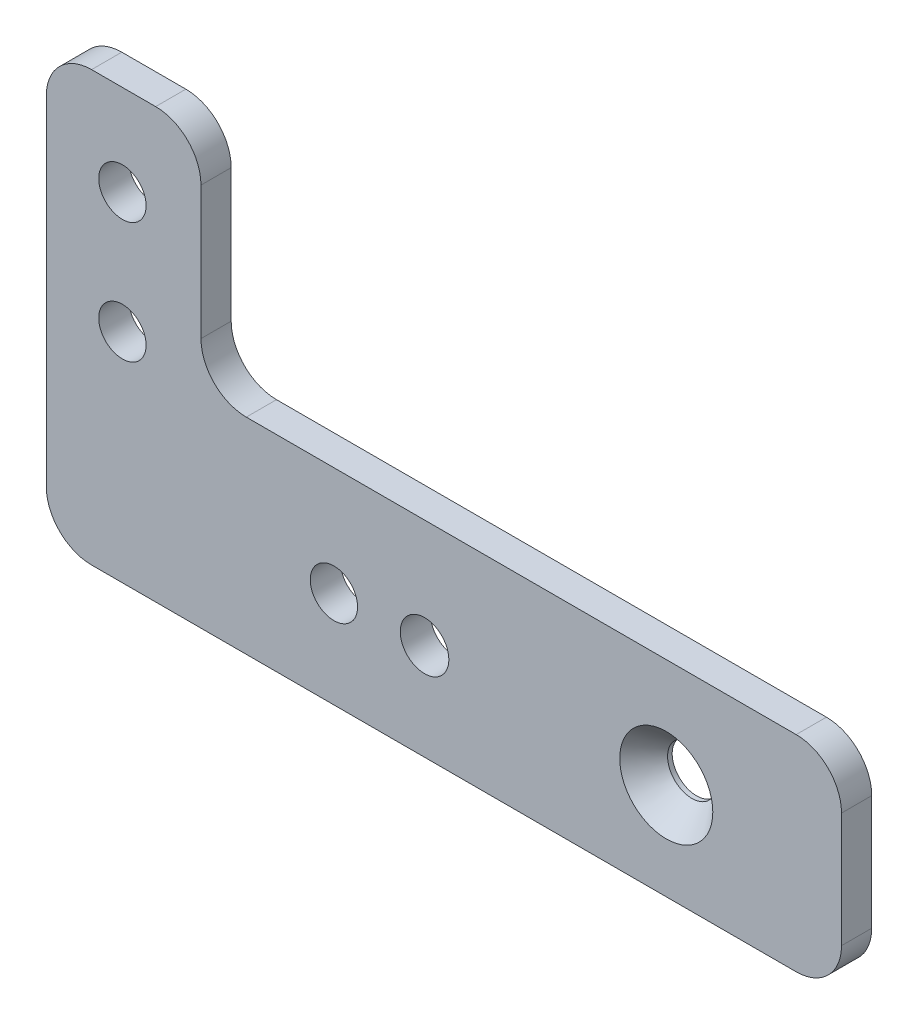
ISO-10303-21;
HEADER;
FILE_DESCRIPTION(('STEP AP214'),'2;1');
FILE_NAME('part.step','',(''),(''),'','','');
FILE_SCHEMA(('AUTOMOTIVE_DESIGN { 1 0 10303 214 1 1 1 1 }'));
ENDSEC;
DATA;
#1=APPLICATION_CONTEXT('core data for automotive mechanical design processes');
#2=APPLICATION_PROTOCOL_DEFINITION('international standard','automotive_design',2000,#1);
#3=PRODUCT_CONTEXT('',#1,'mechanical');
#4=PRODUCT('Part','Part','',(#3));
#5=PRODUCT_RELATED_PRODUCT_CATEGORY('part','',(#4));
#6=PRODUCT_DEFINITION_FORMATION('','',#4);
#7=PRODUCT_DEFINITION_CONTEXT('part definition',#1,'design');
#8=PRODUCT_DEFINITION('design','',#6,#7);
#9=PRODUCT_DEFINITION_SHAPE('','',#8);
#10=(LENGTH_UNIT() NAMED_UNIT(*) SI_UNIT(.MILLI.,.METRE.));
#11=(NAMED_UNIT(*) PLANE_ANGLE_UNIT() SI_UNIT($,.RADIAN.));
#12=(NAMED_UNIT(*) SI_UNIT($,.STERADIAN.) SOLID_ANGLE_UNIT());
#13=UNCERTAINTY_MEASURE_WITH_UNIT(LENGTH_MEASURE(1.E-05),#10,'distance_accuracy_value','');
#14=(GEOMETRIC_REPRESENTATION_CONTEXT(3) GLOBAL_UNCERTAINTY_ASSIGNED_CONTEXT((#13)) GLOBAL_UNIT_ASSIGNED_CONTEXT((#10,
#11,#12)) REPRESENTATION_CONTEXT('',''));
#15=CARTESIAN_POINT('',(0.,0.,0.));
#16=DIRECTION('',(0.,0.,1.));
#17=DIRECTION('',(1.,0.,0.));
#18=AXIS2_PLACEMENT_3D('',#15,#16,#17);
#19=CARTESIAN_POINT('',(-37.846,0.,3.175));
#20=DIRECTION('',(-1.,0.,0.));
#21=DIRECTION('',(0.,0.,1.));
#22=AXIS2_PLACEMENT_3D('',#19,#20,#21);
#23=PLANE('',#22);
#24=DIRECTION('',(0.,1.,0.));
#25=VECTOR('',#24,1.);
#26=CARTESIAN_POINT('',(-37.846,0.,3.175));
#27=LINE('',#26,#25);
#28=CARTESIAN_POINT('',(-37.846,-16.51,3.175));
#29=VERTEX_POINT('',#28);
#30=CARTESIAN_POINT('',(-37.846,19.05,3.175));
#31=VERTEX_POINT('',#30);
#32=EDGE_CURVE('E256',#29,#31,#27,.T.);
#33=ORIENTED_EDGE('',*,*,#32,.T.);
#34=DIRECTION('',(0.,0.,-1.));
#35=VECTOR('',#34,1.);
#36=CARTESIAN_POINT('',(-37.846,19.05,3.175));
#37=LINE('',#36,#35);
#38=CARTESIAN_POINT('',(-37.846,19.05,0.));
#39=VERTEX_POINT('',#38);
#40=EDGE_CURVE('E137',#31,#39,#37,.T.);
#41=ORIENTED_EDGE('',*,*,#40,.T.);
#42=DIRECTION('',(0.,1.,0.));
#43=VECTOR('',#42,1.);
#44=CARTESIAN_POINT('',(-37.846,0.,0.));
#45=LINE('',#44,#43);
#46=CARTESIAN_POINT('',(-37.846,-16.51,0.));
#47=VERTEX_POINT('',#46);
#48=EDGE_CURVE('E129',#47,#39,#45,.T.);
#49=ORIENTED_EDGE('',*,*,#48,.F.);
#50=DIRECTION('',(0.,0.,-1.));
#51=VECTOR('',#50,1.);
#52=CARTESIAN_POINT('',(-37.846,-16.51,3.175));
#53=LINE('',#52,#51);
#54=EDGE_CURVE('E142',#47,#29,#53,.F.);
#55=ORIENTED_EDGE('',*,*,#54,.T.);
#56=EDGE_LOOP('',(#33,#41,#49,#55));
#57=FACE_BOUND('',#56,.T.);
#58=ADVANCED_FACE('F37',(#57),#23,.T.);
#59=CARTESIAN_POINT('',(0.,-21.2725,3.175));
#60=DIRECTION('',(0.,1.,0.));
#61=DIRECTION('',(0.,0.,1.));
#62=AXIS2_PLACEMENT_3D('',#59,#60,#61);
#63=PLANE('',#62);
#64=DIRECTION('',(1.,0.,0.));
#65=VECTOR('',#64,1.);
#66=CARTESIAN_POINT('',(0.,-21.2725,0.));
#67=LINE('',#66,#65);
#68=CARTESIAN_POINT('',(-33.0835,-21.2725,0.));
#69=VERTEX_POINT('',#68);
#70=CARTESIAN_POINT('',(40.9575,-21.2725,0.));
#71=VERTEX_POINT('',#70);
#72=EDGE_CURVE('E131',#69,#71,#67,.T.);
#73=ORIENTED_EDGE('',*,*,#72,.T.);
#74=DIRECTION('',(0.,0.,-1.));
#75=VECTOR('',#74,1.);
#76=CARTESIAN_POINT('',(40.9575,-21.2725,3.175));
#77=LINE('',#76,#75);
#78=CARTESIAN_POINT('',(40.9575,-21.2725,3.175));
#79=VERTEX_POINT('',#78);
#80=EDGE_CURVE('E196',#71,#79,#77,.F.);
#81=ORIENTED_EDGE('',*,*,#80,.T.);
#82=DIRECTION('',(1.,0.,0.));
#83=VECTOR('',#82,1.);
#84=CARTESIAN_POINT('',(0.,-21.2725,3.175));
#85=LINE('',#84,#83);
#86=CARTESIAN_POINT('',(-33.0835,-21.2725,3.175));
#87=VERTEX_POINT('',#86);
#88=EDGE_CURVE('E258',#87,#79,#85,.T.);
#89=ORIENTED_EDGE('',*,*,#88,.F.);
#90=DIRECTION('',(0.,0.,-1.));
#91=VECTOR('',#90,1.);
#92=CARTESIAN_POINT('',(-33.0835,-21.2725,0.));
#93=LINE('',#92,#91);
#94=EDGE_CURVE('E194',#87,#69,#93,.T.);
#95=ORIENTED_EDGE('',*,*,#94,.T.);
#96=EDGE_LOOP('',(#73,#81,#89,#95));
#97=FACE_BOUND('',#96,.T.);
#98=ADVANCED_FACE('F277',(#97),#63,.F.);
#99=CARTESIAN_POINT('',(45.72,0.,3.175));
#100=DIRECTION('',(-1.,0.,0.));
#101=DIRECTION('',(0.,0.,1.));
#102=AXIS2_PLACEMENT_3D('',#99,#100,#101);
#103=PLANE('',#102);
#104=DIRECTION('',(0.,1.,0.));
#105=VECTOR('',#104,1.);
#106=CARTESIAN_POINT('',(45.72,0.,0.));
#107=LINE('',#106,#105);
#108=CARTESIAN_POINT('',(45.72,-16.51,0.));
#109=VERTEX_POINT('',#108);
#110=CARTESIAN_POINT('',(45.72,-4.445,0.));
#111=VERTEX_POINT('',#110);
#112=EDGE_CURVE('E209',#109,#111,#107,.T.);
#113=ORIENTED_EDGE('',*,*,#112,.T.);
#114=DIRECTION('',(0.,0.,-1.));
#115=VECTOR('',#114,1.);
#116=CARTESIAN_POINT('',(45.72,-4.445,3.175));
#117=LINE('',#116,#115);
#118=CARTESIAN_POINT('',(45.72,-4.445,3.175));
#119=VERTEX_POINT('',#118);
#120=EDGE_CURVE('E192',#111,#119,#117,.F.);
#121=ORIENTED_EDGE('',*,*,#120,.T.);
#122=DIRECTION('',(0.,1.,0.));
#123=VECTOR('',#122,1.);
#124=CARTESIAN_POINT('',(45.72,0.,3.175));
#125=LINE('',#124,#123);
#126=CARTESIAN_POINT('',(45.72,-16.51,3.175));
#127=VERTEX_POINT('',#126);
#128=EDGE_CURVE('E216',#127,#119,#125,.T.);
#129=ORIENTED_EDGE('',*,*,#128,.F.);
#130=DIRECTION('',(0.,0.,-1.));
#131=VECTOR('',#130,1.);
#132=CARTESIAN_POINT('',(45.72,-16.51,3.175));
#133=LINE('',#132,#131);
#134=EDGE_CURVE('E189',#127,#109,#133,.T.);
#135=ORIENTED_EDGE('',*,*,#134,.T.);
#136=EDGE_LOOP('',(#113,#121,#129,#135));
#137=FACE_BOUND('',#136,.T.);
#138=ADVANCED_FACE('F272',(#137),#103,.F.);
#139=CARTESIAN_POINT('',(0.,0.317499999999993,3.175));
#140=DIRECTION('',(0.,-1.,0.));
#141=DIRECTION('',(1.,0.,0.));
#142=AXIS2_PLACEMENT_3D('',#139,#140,#141);
#143=PLANE('',#142);
#144=DIRECTION('',(-1.,0.,0.));
#145=VECTOR('',#144,1.);
#146=CARTESIAN_POINT('',(0.,0.317499999999993,0.));
#147=LINE('',#146,#145);
#148=CARTESIAN_POINT('',(40.9575,0.317499999999998,0.));
#149=VERTEX_POINT('',#148);
#150=CARTESIAN_POINT('',(-16.8275,0.317499999999991,0.));
#151=VERTEX_POINT('',#150);
#152=EDGE_CURVE('E200',#149,#151,#147,.T.);
#153=ORIENTED_EDGE('',*,*,#152,.T.);
#154=DIRECTION('',(0.,0.,-1.));
#155=VECTOR('',#154,1.);
#156=CARTESIAN_POINT('',(-16.8275,0.317499999999991,3.175));
#157=LINE('',#156,#155);
#158=CARTESIAN_POINT('',(-16.8275,0.317499999999991,3.175));
#159=VERTEX_POINT('',#158);
#160=EDGE_CURVE('E187',#151,#159,#157,.F.);
#161=ORIENTED_EDGE('',*,*,#160,.T.);
#162=DIRECTION('',(-1.,0.,0.));
#163=VECTOR('',#162,1.);
#164=CARTESIAN_POINT('',(0.,0.317499999999993,3.175));
#165=LINE('',#164,#163);
#166=CARTESIAN_POINT('',(40.9575,0.317499999999998,3.175));
#167=VERTEX_POINT('',#166);
#168=EDGE_CURVE('E214',#167,#159,#165,.T.);
#169=ORIENTED_EDGE('',*,*,#168,.F.);
#170=DIRECTION('',(0.,0.,-1.));
#171=VECTOR('',#170,1.);
#172=CARTESIAN_POINT('',(40.9575,0.317499999999998,3.175));
#173=LINE('',#172,#171);
#174=EDGE_CURVE('E184',#167,#149,#173,.T.);
#175=ORIENTED_EDGE('',*,*,#174,.T.);
#176=EDGE_LOOP('',(#153,#161,#169,#175));
#177=FACE_BOUND('',#176,.T.);
#178=ADVANCED_FACE('F206',(#177),#143,.F.);
#179=CARTESIAN_POINT('',(-21.59,0.,3.175));
#180=DIRECTION('',(1.,0.,0.));
#181=DIRECTION('',(0.,1.,0.));
#182=AXIS2_PLACEMENT_3D('',#179,#180,#181);
#183=PLANE('',#182);
#184=DIRECTION('',(0.,-1.,0.));
#185=VECTOR('',#184,1.);
#186=CARTESIAN_POINT('',(-21.59,0.,0.));
#187=LINE('',#186,#185);
#188=CARTESIAN_POINT('',(-21.59,19.05,0.));
#189=VERTEX_POINT('',#188);
#190=CARTESIAN_POINT('',(-21.59,5.07999999999999,0.));
#191=VERTEX_POINT('',#190);
#192=EDGE_CURVE('E201',#189,#191,#187,.T.);
#193=ORIENTED_EDGE('',*,*,#192,.F.);
#194=DIRECTION('',(0.,0.,-1.));
#195=VECTOR('',#194,1.);
#196=CARTESIAN_POINT('',(-21.59,19.05,3.175));
#197=LINE('',#196,#195);
#198=CARTESIAN_POINT('',(-21.59,19.05,3.175));
#199=VERTEX_POINT('',#198);
#200=EDGE_CURVE('E57',#189,#199,#197,.F.);
#201=ORIENTED_EDGE('',*,*,#200,.T.);
#202=DIRECTION('',(0.,-1.,0.));
#203=VECTOR('',#202,1.);
#204=CARTESIAN_POINT('',(-21.59,0.,3.175));
#205=LINE('',#204,#203);
#206=CARTESIAN_POINT('',(-21.59,5.07999999999999,3.175));
#207=VERTEX_POINT('',#206);
#208=EDGE_CURVE('E153',#199,#207,#205,.T.);
#209=ORIENTED_EDGE('',*,*,#208,.T.);
#210=DIRECTION('',(0.,0.,-1.));
#211=VECTOR('',#210,1.);
#212=CARTESIAN_POINT('',(-21.59,5.07999999999999,3.175));
#213=LINE('',#212,#211);
#214=EDGE_CURVE('E180',#207,#191,#213,.T.);
#215=ORIENTED_EDGE('',*,*,#214,.T.);
#216=EDGE_LOOP('',(#193,#201,#209,#215));
#217=FACE_BOUND('',#216,.T.);
#218=ADVANCED_FACE('F212',(#217),#183,.T.);
#219=CARTESIAN_POINT('',(-29.845,1.5875,3.175));
#220=DIRECTION('',(0.,0.,-1.));
#221=DIRECTION('',(-1.,0.,0.));
#222=AXIS2_PLACEMENT_3D('',#219,#220,#221);
#223=CYLINDRICAL_SURFACE('',#222,2.4892);
#224=CARTESIAN_POINT('',(-29.845,1.5875,3.175));
#225=DIRECTION('',(0.,0.,1.));
#226=DIRECTION('',(1.,0.,0.));
#227=AXIS2_PLACEMENT_3D('',#224,#225,#226);
#228=CIRCLE('',#227,2.4892);
#229=CARTESIAN_POINT('',(-27.3558,1.5875,3.175));
#230=VERTEX_POINT('',#229);
#231=EDGE_CURVE('E253',#230,#230,#228,.T.);
#232=ORIENTED_EDGE('',*,*,#231,.T.);
#233=EDGE_LOOP('',(#232));
#234=FACE_BOUND('',#233,.T.);
#235=CARTESIAN_POINT('',(-29.845,1.5875,0.));
#236=DIRECTION('',(0.,0.,1.));
#237=DIRECTION('',(1.,0.,0.));
#238=AXIS2_PLACEMENT_3D('',#235,#236,#237);
#239=CIRCLE('',#238,2.4892);
#240=CARTESIAN_POINT('',(-27.3558,1.5875,0.));
#241=VERTEX_POINT('',#240);
#242=EDGE_CURVE('E145',#241,#241,#239,.T.);
#243=ORIENTED_EDGE('',*,*,#242,.F.);
#244=EDGE_LOOP('',(#243));
#245=FACE_BOUND('',#244,.T.);
#246=ADVANCED_FACE('F304',(#234,#245),#223,.F.);
#247=CARTESIAN_POINT('',(-29.845,14.2875,3.175));
#248=DIRECTION('',(0.,0.,-1.));
#249=DIRECTION('',(-1.,0.,0.));
#250=AXIS2_PLACEMENT_3D('',#247,#248,#249);
#251=CYLINDRICAL_SURFACE('',#250,2.4892);
#252=CARTESIAN_POINT('',(-29.845,14.2875,3.175));
#253=DIRECTION('',(0.,0.,1.));
#254=DIRECTION('',(1.,0.,0.));
#255=AXIS2_PLACEMENT_3D('',#252,#253,#254);
#256=CIRCLE('',#255,2.4892);
#257=CARTESIAN_POINT('',(-27.3558,14.2875,3.175));
#258=VERTEX_POINT('',#257);
#259=EDGE_CURVE('E246',#258,#258,#256,.T.);
#260=ORIENTED_EDGE('',*,*,#259,.T.);
#261=EDGE_LOOP('',(#260));
#262=FACE_BOUND('',#261,.T.);
#263=CARTESIAN_POINT('',(-29.845,14.2875,0.));
#264=DIRECTION('',(0.,0.,1.));
#265=DIRECTION('',(1.,0.,0.));
#266=AXIS2_PLACEMENT_3D('',#263,#264,#265);
#267=CIRCLE('',#266,2.4892);
#268=CARTESIAN_POINT('',(-27.3558,14.2875,0.));
#269=VERTEX_POINT('',#268);
#270=EDGE_CURVE('E230',#269,#269,#267,.T.);
#271=ORIENTED_EDGE('',*,*,#270,.F.);
#272=EDGE_LOOP('',(#271));
#273=FACE_BOUND('',#272,.T.);
#274=ADVANCED_FACE('F307',(#262,#273),#251,.F.);
#275=CARTESIAN_POINT('',(-7.61999999999997,-11.1125,3.175));
#276=DIRECTION('',(0.,0.,-1.));
#277=DIRECTION('',(-1.,0.,0.));
#278=AXIS2_PLACEMENT_3D('',#275,#276,#277);
#279=CYLINDRICAL_SURFACE('',#278,2.4892);
#280=CARTESIAN_POINT('',(-7.61999999999997,-11.1125,3.175));
#281=DIRECTION('',(0.,0.,1.));
#282=DIRECTION('',(1.,0.,0.));
#283=AXIS2_PLACEMENT_3D('',#280,#281,#282);
#284=CIRCLE('',#283,2.4892);
#285=CARTESIAN_POINT('',(-5.13079999999997,-11.1125,3.175));
#286=VERTEX_POINT('',#285);
#287=EDGE_CURVE('E241',#286,#286,#284,.T.);
#288=ORIENTED_EDGE('',*,*,#287,.T.);
#289=EDGE_LOOP('',(#288));
#290=FACE_BOUND('',#289,.T.);
#291=CARTESIAN_POINT('',(-7.61999999999997,-11.1125,0.));
#292=DIRECTION('',(0.,0.,1.));
#293=DIRECTION('',(1.,0.,0.));
#294=AXIS2_PLACEMENT_3D('',#291,#292,#293);
#295=CIRCLE('',#294,2.4892);
#296=CARTESIAN_POINT('',(-5.13079999999997,-11.1125,0.));
#297=VERTEX_POINT('',#296);
#298=EDGE_CURVE('E227',#297,#297,#295,.T.);
#299=ORIENTED_EDGE('',*,*,#298,.F.);
#300=EDGE_LOOP('',(#299));
#301=FACE_BOUND('',#300,.T.);
#302=ADVANCED_FACE('F311',(#290,#301),#279,.F.);
#303=CARTESIAN_POINT('',(1.90500000000002,-11.1125,3.175));
#304=DIRECTION('',(0.,0.,-1.));
#305=DIRECTION('',(-1.,0.,0.));
#306=AXIS2_PLACEMENT_3D('',#303,#304,#305);
#307=CYLINDRICAL_SURFACE('',#306,2.5527);
#308=CARTESIAN_POINT('',(1.90500000000002,-11.1125,3.175));
#309=DIRECTION('',(0.,0.,1.));
#310=DIRECTION('',(1.,0.,0.));
#311=AXIS2_PLACEMENT_3D('',#308,#309,#310);
#312=CIRCLE('',#311,2.5527);
#313=CARTESIAN_POINT('',(4.45770000000002,-11.1125,3.175));
#314=VERTEX_POINT('',#313);
#315=EDGE_CURVE('E238',#314,#314,#312,.T.);
#316=ORIENTED_EDGE('',*,*,#315,.T.);
#317=EDGE_LOOP('',(#316));
#318=FACE_BOUND('',#317,.T.);
#319=CARTESIAN_POINT('',(1.90500000000002,-11.1125,0.));
#320=DIRECTION('',(0.,0.,1.));
#321=DIRECTION('',(1.,0.,0.));
#322=AXIS2_PLACEMENT_3D('',#319,#320,#321);
#323=CIRCLE('',#322,2.5527);
#324=CARTESIAN_POINT('',(4.45770000000002,-11.1125,0.));
#325=VERTEX_POINT('',#324);
#326=EDGE_CURVE('E223',#325,#325,#323,.T.);
#327=ORIENTED_EDGE('',*,*,#326,.F.);
#328=EDGE_LOOP('',(#327));
#329=FACE_BOUND('',#328,.T.);
#330=ADVANCED_FACE('F315',(#318,#329),#307,.F.);
#331=CARTESIAN_POINT('',(27.305,-11.1125,3.175));
#332=DIRECTION('',(0.,0.,-1.));
#333=DIRECTION('',(-1.,0.,0.));
#334=AXIS2_PLACEMENT_3D('',#331,#332,#333);
#335=CYLINDRICAL_SURFACE('',#334,2.55269999999999);
#336=CARTESIAN_POINT('',(27.305,-11.1125,0.486819106005942));
#337=DIRECTION('',(0.,0.,1.));
#338=DIRECTION('',(1.,0.,0.));
#339=AXIS2_PLACEMENT_3D('',#336,#337,#338);
#340=CIRCLE('',#339,2.5527);
#341=CARTESIAN_POINT('',(29.8577,-11.1125,0.486819106005942));
#342=VERTEX_POINT('',#341);
#343=EDGE_CURVE('E224',#342,#342,#340,.T.);
#344=ORIENTED_EDGE('',*,*,#343,.T.);
#345=EDGE_LOOP('',(#344));
#346=FACE_BOUND('',#345,.T.);
#347=CARTESIAN_POINT('',(27.305,-11.1125,0.));
#348=DIRECTION('',(0.,0.,1.));
#349=DIRECTION('',(1.,0.,0.));
#350=AXIS2_PLACEMENT_3D('',#347,#348,#349);
#351=CIRCLE('',#350,2.55269999999999);
#352=CARTESIAN_POINT('',(29.8577,-11.1125,0.));
#353=VERTEX_POINT('',#352);
#354=EDGE_CURVE('E220',#353,#353,#351,.T.);
#355=ORIENTED_EDGE('',*,*,#354,.F.);
#356=EDGE_LOOP('',(#355));
#357=FACE_BOUND('',#356,.T.);
#358=ADVANCED_FACE('F319',(#346,#357),#335,.F.);
#359=CARTESIAN_POINT('',(0.,23.8125,3.175));
#360=DIRECTION('',(0.,1.,0.));
#361=DIRECTION('',(0.,0.,1.));
#362=AXIS2_PLACEMENT_3D('',#359,#360,#361);
#363=PLANE('',#362);
#364=DIRECTION('',(1.,0.,0.));
#365=VECTOR('',#364,1.);
#366=CARTESIAN_POINT('',(0.,23.8125,0.));
#367=LINE('',#366,#365);
#368=CARTESIAN_POINT('',(-33.0835,23.8125,0.));
#369=VERTEX_POINT('',#368);
#370=CARTESIAN_POINT('',(-26.3525,23.8125,0.));
#371=VERTEX_POINT('',#370);
#372=EDGE_CURVE('E156',#369,#371,#367,.T.);
#373=ORIENTED_EDGE('',*,*,#372,.F.);
#374=DIRECTION('',(0.,0.,-1.));
#375=VECTOR('',#374,1.);
#376=CARTESIAN_POINT('',(-33.0835,23.8125,3.175));
#377=LINE('',#376,#375);
#378=CARTESIAN_POINT('',(-33.0835,23.8125,3.175));
#379=VERTEX_POINT('',#378);
#380=EDGE_CURVE('E169',#369,#379,#377,.F.);
#381=ORIENTED_EDGE('',*,*,#380,.T.);
#382=DIRECTION('',(1.,0.,0.));
#383=VECTOR('',#382,1.);
#384=CARTESIAN_POINT('',(0.,23.8125,3.175));
#385=LINE('',#384,#383);
#386=CARTESIAN_POINT('',(-26.3525,23.8125,3.175));
#387=VERTEX_POINT('',#386);
#388=EDGE_CURVE('E149',#379,#387,#385,.T.);
#389=ORIENTED_EDGE('',*,*,#388,.T.);
#390=DIRECTION('',(0.,0.,-1.));
#391=VECTOR('',#390,1.);
#392=CARTESIAN_POINT('',(-26.3525,23.8125,3.175));
#393=LINE('',#392,#391);
#394=EDGE_CURVE('E166',#387,#371,#393,.T.);
#395=ORIENTED_EDGE('',*,*,#394,.T.);
#396=EDGE_LOOP('',(#373,#381,#389,#395));
#397=FACE_BOUND('',#396,.T.);
#398=ADVANCED_FACE('F284',(#397),#363,.T.);
#399=CARTESIAN_POINT('',(0.,0.,3.175));
#400=DIRECTION('',(0.,0.,1.));
#401=DIRECTION('',(1.,0.,0.));
#402=AXIS2_PLACEMENT_3D('',#399,#400,#401);
#403=PLANE('',#402);
#404=CARTESIAN_POINT('',(27.305,-11.1125,3.175));
#405=DIRECTION('',(0.,0.,1.));
#406=DIRECTION('',(1.,0.,0.));
#407=AXIS2_PLACEMENT_3D('',#404,#405,#406);
#408=CIRCLE('',#407,4.8895);
#409=CARTESIAN_POINT('',(32.1945,-11.1125,3.175));
#410=VERTEX_POINT('',#409);
#411=EDGE_CURVE('E475',#410,#410,#408,.T.);
#412=ORIENTED_EDGE('',*,*,#411,.F.);
#413=EDGE_LOOP('',(#412));
#414=FACE_BOUND('',#413,.T.);
#415=ORIENTED_EDGE('',*,*,#315,.F.);
#416=EDGE_LOOP('',(#415));
#417=FACE_BOUND('',#416,.T.);
#418=ORIENTED_EDGE('',*,*,#287,.F.);
#419=EDGE_LOOP('',(#418));
#420=FACE_BOUND('',#419,.T.);
#421=ORIENTED_EDGE('',*,*,#259,.F.);
#422=EDGE_LOOP('',(#421));
#423=FACE_BOUND('',#422,.T.);
#424=ORIENTED_EDGE('',*,*,#231,.F.);
#425=EDGE_LOOP('',(#424));
#426=FACE_BOUND('',#425,.T.);
#427=ORIENTED_EDGE('',*,*,#388,.F.);
#428=CARTESIAN_POINT('',(-33.0835,19.05,3.175));
#429=DIRECTION('',(0.,0.,1.));
#430=DIRECTION('',(1.,0.,0.));
#431=AXIS2_PLACEMENT_3D('',#428,#429,#430);
#432=CIRCLE('',#431,4.7625);
#433=EDGE_CURVE('E178',#379,#31,#432,.T.);
#434=ORIENTED_EDGE('',*,*,#433,.T.);
#435=ORIENTED_EDGE('',*,*,#32,.F.);
#436=CARTESIAN_POINT('',(-33.0835,-16.51,3.175));
#437=DIRECTION('',(0.,0.,1.));
#438=DIRECTION('',(1.,0.,0.));
#439=AXIS2_PLACEMENT_3D('',#436,#437,#438);
#440=CIRCLE('',#439,4.7625);
#441=EDGE_CURVE('E148',#29,#87,#440,.T.);
#442=ORIENTED_EDGE('',*,*,#441,.T.);
#443=ORIENTED_EDGE('',*,*,#88,.T.);
#444=CARTESIAN_POINT('',(40.9575,-16.51,3.175));
#445=DIRECTION('',(0.,0.,1.));
#446=DIRECTION('',(1.,0.,0.));
#447=AXIS2_PLACEMENT_3D('',#444,#445,#446);
#448=CIRCLE('',#447,4.7625);
#449=EDGE_CURVE('E172',#79,#127,#448,.T.);
#450=ORIENTED_EDGE('',*,*,#449,.T.);
#451=ORIENTED_EDGE('',*,*,#128,.T.);
#452=CARTESIAN_POINT('',(40.9575,-4.445,3.175));
#453=DIRECTION('',(0.,0.,1.));
#454=DIRECTION('',(1.,0.,0.));
#455=AXIS2_PLACEMENT_3D('',#452,#453,#454);
#456=CIRCLE('',#455,4.7625);
#457=EDGE_CURVE('E174',#119,#167,#456,.T.);
#458=ORIENTED_EDGE('',*,*,#457,.T.);
#459=ORIENTED_EDGE('',*,*,#168,.T.);
#460=CARTESIAN_POINT('',(-16.8275,5.07999999999999,3.175));
#461=DIRECTION('',(0.,0.,1.));
#462=DIRECTION('',(1.,0.,0.));
#463=AXIS2_PLACEMENT_3D('',#460,#461,#462);
#464=CIRCLE('',#463,4.7625);
#465=EDGE_CURVE('E11',#159,#207,#464,.F.);
#466=ORIENTED_EDGE('',*,*,#465,.T.);
#467=ORIENTED_EDGE('',*,*,#208,.F.);
#468=CARTESIAN_POINT('',(-26.3525,19.05,3.175));
#469=DIRECTION('',(0.,0.,1.));
#470=DIRECTION('',(1.,0.,0.));
#471=AXIS2_PLACEMENT_3D('',#468,#469,#470);
#472=CIRCLE('',#471,4.7625);
#473=EDGE_CURVE('E176',#199,#387,#472,.T.);
#474=ORIENTED_EDGE('',*,*,#473,.T.);
#475=EDGE_LOOP('',(#427,#434,#435,#442,#443,#450,#451,#458,#459,#466,#467,#474));
#476=FACE_BOUND('',#475,.T.);
#477=ADVANCED_FACE('F264',(#414,#417,#420,#423,#426,#476),#403,.T.);
#478=CARTESIAN_POINT('',(0.,0.,0.));
#479=DIRECTION('',(0.,0.,1.));
#480=DIRECTION('',(1.,0.,0.));
#481=AXIS2_PLACEMENT_3D('',#478,#479,#480);
#482=PLANE('',#481);
#483=ORIENTED_EDGE('',*,*,#354,.T.);
#484=EDGE_LOOP('',(#483));
#485=FACE_BOUND('',#484,.T.);
#486=ORIENTED_EDGE('',*,*,#326,.T.);
#487=EDGE_LOOP('',(#486));
#488=FACE_BOUND('',#487,.T.);
#489=ORIENTED_EDGE('',*,*,#298,.T.);
#490=EDGE_LOOP('',(#489));
#491=FACE_BOUND('',#490,.T.);
#492=ORIENTED_EDGE('',*,*,#270,.T.);
#493=EDGE_LOOP('',(#492));
#494=FACE_BOUND('',#493,.T.);
#495=ORIENTED_EDGE('',*,*,#242,.T.);
#496=EDGE_LOOP('',(#495));
#497=FACE_BOUND('',#496,.T.);
#498=ORIENTED_EDGE('',*,*,#48,.T.);
#499=CARTESIAN_POINT('',(-33.0835,19.05,0.));
#500=DIRECTION('',(0.,0.,1.));
#501=DIRECTION('',(1.,0.,0.));
#502=AXIS2_PLACEMENT_3D('',#499,#500,#501);
#503=CIRCLE('',#502,4.7625);
#504=EDGE_CURVE('E164',#39,#369,#503,.F.);
#505=ORIENTED_EDGE('',*,*,#504,.T.);
#506=ORIENTED_EDGE('',*,*,#372,.T.);
#507=CARTESIAN_POINT('',(-26.3525,19.05,0.));
#508=DIRECTION('',(0.,0.,1.));
#509=DIRECTION('',(1.,0.,0.));
#510=AXIS2_PLACEMENT_3D('',#507,#508,#509);
#511=CIRCLE('',#510,4.7625);
#512=EDGE_CURVE('E162',#371,#189,#511,.F.);
#513=ORIENTED_EDGE('',*,*,#512,.T.);
#514=ORIENTED_EDGE('',*,*,#192,.T.);
#515=CARTESIAN_POINT('',(-16.8275,5.07999999999999,0.));
#516=DIRECTION('',(0.,0.,1.));
#517=DIRECTION('',(1.,0.,0.));
#518=AXIS2_PLACEMENT_3D('',#515,#516,#517);
#519=CIRCLE('',#518,4.7625);
#520=EDGE_CURVE('E45',#191,#151,#519,.T.);
#521=ORIENTED_EDGE('',*,*,#520,.T.);
#522=ORIENTED_EDGE('',*,*,#152,.F.);
#523=CARTESIAN_POINT('',(40.9575,-4.445,0.));
#524=DIRECTION('',(0.,0.,1.));
#525=DIRECTION('',(1.,0.,0.));
#526=AXIS2_PLACEMENT_3D('',#523,#524,#525);
#527=CIRCLE('',#526,4.7625);
#528=EDGE_CURVE('E160',#149,#111,#527,.F.);
#529=ORIENTED_EDGE('',*,*,#528,.T.);
#530=ORIENTED_EDGE('',*,*,#112,.F.);
#531=CARTESIAN_POINT('',(40.9575,-16.51,0.));
#532=DIRECTION('',(0.,0.,1.));
#533=DIRECTION('',(1.,0.,0.));
#534=AXIS2_PLACEMENT_3D('',#531,#532,#533);
#535=CIRCLE('',#534,4.7625);
#536=EDGE_CURVE('E136',#109,#71,#535,.F.);
#537=ORIENTED_EDGE('',*,*,#536,.T.);
#538=ORIENTED_EDGE('',*,*,#72,.F.);
#539=CARTESIAN_POINT('',(-33.0835,-16.51,0.));
#540=DIRECTION('',(0.,0.,1.));
#541=DIRECTION('',(1.,0.,0.));
#542=AXIS2_PLACEMENT_3D('',#539,#540,#541);
#543=CIRCLE('',#542,4.7625);
#544=EDGE_CURVE('E126',#69,#47,#543,.F.);
#545=ORIENTED_EDGE('',*,*,#544,.T.);
#546=EDGE_LOOP('',(#498,#505,#506,#513,#514,#521,#522,#529,#530,#537,#538,#545));
#547=FACE_BOUND('',#546,.T.);
#548=ADVANCED_FACE('F128',(#485,#488,#491,#494,#497,#547),#482,.F.);
#549=CARTESIAN_POINT('',(-33.0835,19.05,3.175));
#550=DIRECTION('',(0.,0.,-1.));
#551=DIRECTION('',(-1.,0.,0.));
#552=AXIS2_PLACEMENT_3D('',#549,#550,#551);
#553=CYLINDRICAL_SURFACE('',#552,4.7625);
#554=ORIENTED_EDGE('',*,*,#433,.F.);
#555=ORIENTED_EDGE('',*,*,#380,.F.);
#556=ORIENTED_EDGE('',*,*,#504,.F.);
#557=ORIENTED_EDGE('',*,*,#40,.F.);
#558=EDGE_LOOP('',(#554,#555,#556,#557));
#559=FACE_BOUND('',#558,.T.);
#560=ADVANCED_FACE('F281',(#559),#553,.T.);
#561=CARTESIAN_POINT('',(-26.3525,19.05,3.175));
#562=DIRECTION('',(0.,0.,-1.));
#563=DIRECTION('',(-1.,0.,0.));
#564=AXIS2_PLACEMENT_3D('',#561,#562,#563);
#565=CYLINDRICAL_SURFACE('',#564,4.7625);
#566=ORIENTED_EDGE('',*,*,#473,.F.);
#567=ORIENTED_EDGE('',*,*,#200,.F.);
#568=ORIENTED_EDGE('',*,*,#512,.F.);
#569=ORIENTED_EDGE('',*,*,#394,.F.);
#570=EDGE_LOOP('',(#566,#567,#568,#569));
#571=FACE_BOUND('',#570,.T.);
#572=ADVANCED_FACE('F287',(#571),#565,.T.);
#573=CARTESIAN_POINT('',(-16.8275,5.07999999999999,3.175));
#574=DIRECTION('',(0.,0.,-1.));
#575=DIRECTION('',(-1.,0.,0.));
#576=AXIS2_PLACEMENT_3D('',#573,#574,#575);
#577=CYLINDRICAL_SURFACE('',#576,4.7625);
#578=ORIENTED_EDGE('',*,*,#465,.F.);
#579=ORIENTED_EDGE('',*,*,#160,.F.);
#580=ORIENTED_EDGE('',*,*,#520,.F.);
#581=ORIENTED_EDGE('',*,*,#214,.F.);
#582=EDGE_LOOP('',(#578,#579,#580,#581));
#583=FACE_BOUND('',#582,.T.);
#584=ADVANCED_FACE('F211',(#583),#577,.F.);
#585=CARTESIAN_POINT('',(40.9575,-4.445,3.175));
#586=DIRECTION('',(0.,0.,-1.));
#587=DIRECTION('',(-1.,0.,0.));
#588=AXIS2_PLACEMENT_3D('',#585,#586,#587);
#589=CYLINDRICAL_SURFACE('',#588,4.7625);
#590=ORIENTED_EDGE('',*,*,#457,.F.);
#591=ORIENTED_EDGE('',*,*,#120,.F.);
#592=ORIENTED_EDGE('',*,*,#528,.F.);
#593=ORIENTED_EDGE('',*,*,#174,.F.);
#594=EDGE_LOOP('',(#590,#591,#592,#593));
#595=FACE_BOUND('',#594,.T.);
#596=ADVANCED_FACE('F270',(#595),#589,.T.);
#597=CARTESIAN_POINT('',(40.9575,-16.51,3.175));
#598=DIRECTION('',(0.,0.,-1.));
#599=DIRECTION('',(-1.,0.,0.));
#600=AXIS2_PLACEMENT_3D('',#597,#598,#599);
#601=CYLINDRICAL_SURFACE('',#600,4.7625);
#602=ORIENTED_EDGE('',*,*,#449,.F.);
#603=ORIENTED_EDGE('',*,*,#80,.F.);
#604=ORIENTED_EDGE('',*,*,#536,.F.);
#605=ORIENTED_EDGE('',*,*,#134,.F.);
#606=EDGE_LOOP('',(#602,#603,#604,#605));
#607=FACE_BOUND('',#606,.T.);
#608=ADVANCED_FACE('F274',(#607),#601,.T.);
#609=CARTESIAN_POINT('',(-33.0835,-16.51,3.175));
#610=DIRECTION('',(0.,0.,1.));
#611=DIRECTION('',(1.,0.,0.));
#612=AXIS2_PLACEMENT_3D('',#609,#610,#611);
#613=CYLINDRICAL_SURFACE('',#612,4.7625);
#614=ORIENTED_EDGE('',*,*,#441,.F.);
#615=ORIENTED_EDGE('',*,*,#54,.F.);
#616=ORIENTED_EDGE('',*,*,#544,.F.);
#617=ORIENTED_EDGE('',*,*,#94,.F.);
#618=EDGE_LOOP('',(#614,#615,#616,#617));
#619=FACE_BOUND('',#618,.T.);
#620=ADVANCED_FACE('F39',(#619),#613,.T.);
#621=CARTESIAN_POINT('',(27.305,-11.1125,3.175));
#622=DIRECTION('',(0.,0.,1.));
#623=DIRECTION('',(1.,0.,0.));
#624=AXIS2_PLACEMENT_3D('',#621,#622,#623);
#625=CONICAL_SURFACE('',#624,4.8895,0.715584993317674);
#626=ORIENTED_EDGE('',*,*,#343,.F.);
#627=EDGE_LOOP('',(#626));
#628=FACE_BOUND('',#627,.T.);
#629=ORIENTED_EDGE('',*,*,#411,.T.);
#630=EDGE_LOOP('',(#629));
#631=FACE_BOUND('',#630,.T.);
#632=ADVANCED_FACE('F460',(#628,#631),#625,.F.);
#633=CLOSED_SHELL('',(#58,#98,#138,#178,#218,#246,#274,#302,#330,#358,#398,#477,#548,#560,#572,
#584,#596,#608,#620,#632));
#634=MANIFOLD_SOLID_BREP('B2',#633);
#635=ADVANCED_BREP_SHAPE_REPRESENTATION('',(#18,#634),#14);
#636=SHAPE_DEFINITION_REPRESENTATION(#9,#635);
ENDSEC;
END-ISO-10303-21;
